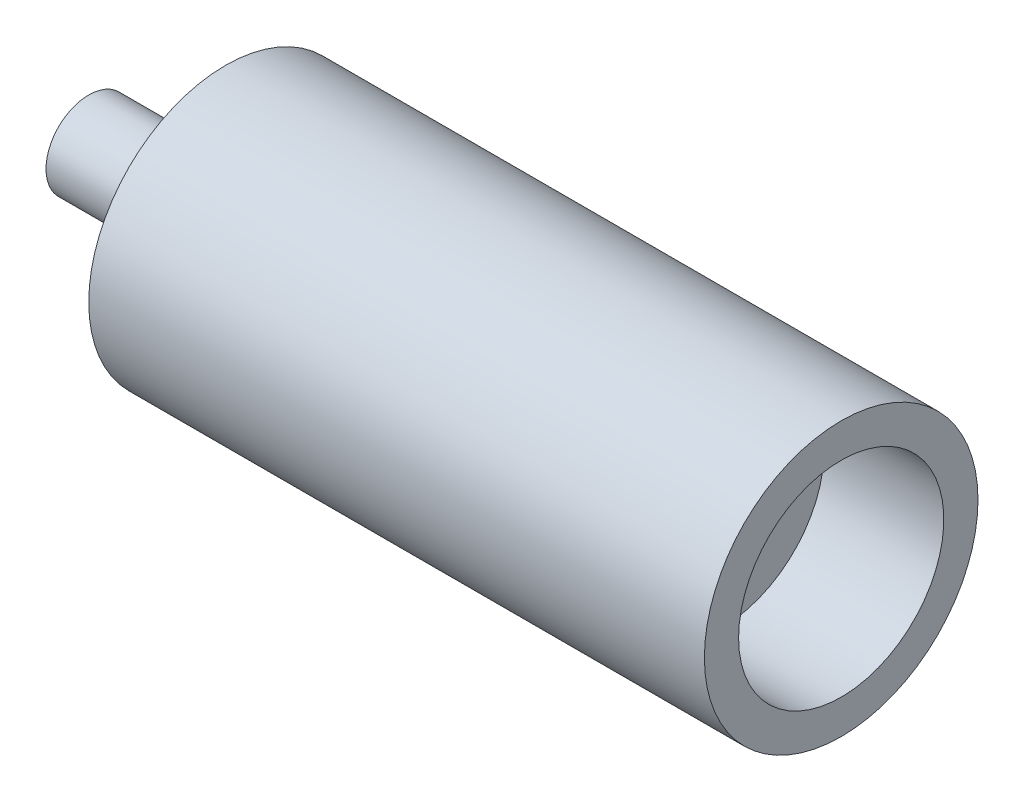
ISO-10303-21;
HEADER;
FILE_DESCRIPTION(('STEP AP214'),'2;1');
FILE_NAME('part.step','',(''),(''),'','','');
FILE_SCHEMA(('AUTOMOTIVE_DESIGN { 1 0 10303 214 1 1 1 1 }'));
ENDSEC;
DATA;
#1=APPLICATION_CONTEXT('core data for automotive mechanical design processes');
#2=APPLICATION_PROTOCOL_DEFINITION('international standard','automotive_design',2000,#1);
#3=PRODUCT_CONTEXT('',#1,'mechanical');
#4=PRODUCT('Part','Part','',(#3));
#5=PRODUCT_RELATED_PRODUCT_CATEGORY('part','',(#4));
#6=PRODUCT_DEFINITION_FORMATION('','',#4);
#7=PRODUCT_DEFINITION_CONTEXT('part definition',#1,'design');
#8=PRODUCT_DEFINITION('design','',#6,#7);
#9=PRODUCT_DEFINITION_SHAPE('','',#8);
#10=(LENGTH_UNIT() NAMED_UNIT(*) SI_UNIT(.MILLI.,.METRE.));
#11=(NAMED_UNIT(*) PLANE_ANGLE_UNIT() SI_UNIT($,.RADIAN.));
#12=(NAMED_UNIT(*) SI_UNIT($,.STERADIAN.) SOLID_ANGLE_UNIT());
#13=UNCERTAINTY_MEASURE_WITH_UNIT(LENGTH_MEASURE(1.E-05),#10,'distance_accuracy_value','');
#14=(GEOMETRIC_REPRESENTATION_CONTEXT(3) GLOBAL_UNCERTAINTY_ASSIGNED_CONTEXT((#13)) GLOBAL_UNIT_ASSIGNED_CONTEXT((#10,
#11,#12)) REPRESENTATION_CONTEXT('',''));
#15=CARTESIAN_POINT('',(0.,0.,0.));
#16=DIRECTION('',(0.,0.,1.));
#17=DIRECTION('',(1.,0.,0.));
#18=AXIS2_PLACEMENT_3D('',#15,#16,#17);
#19=CARTESIAN_POINT('',(1.4249709278377,0.,0.));
#20=DIRECTION('',(-1.,0.,0.));
#21=DIRECTION('',(0.,0.,1.));
#22=AXIS2_PLACEMENT_3D('',#19,#20,#21);
#23=CYLINDRICAL_SURFACE('',#22,12.5);
#24=CARTESIAN_POINT('',(0.,0.,0.));
#25=DIRECTION('',(-1.,0.,0.));
#26=DIRECTION('',(0.,0.,1.));
#27=AXIS2_PLACEMENT_3D('',#24,#25,#26);
#28=CIRCLE('',#27,12.5);
#29=CARTESIAN_POINT('',(0.,0.,12.5));
#30=VERTEX_POINT('',#29);
#31=EDGE_CURVE('E10',#30,#30,#28,.T.);
#32=ORIENTED_EDGE('',*,*,#31,.F.);
#33=EDGE_LOOP('',(#32));
#34=FACE_BOUND('',#33,.T.);
#35=CARTESIAN_POINT('',(30.,0.,0.));
#36=DIRECTION('',(-1.,0.,0.));
#37=DIRECTION('',(0.,0.,1.));
#38=AXIS2_PLACEMENT_3D('',#35,#36,#37);
#39=CIRCLE('',#38,12.5);
#40=CARTESIAN_POINT('',(30.,0.,12.5));
#41=VERTEX_POINT('',#40);
#42=EDGE_CURVE('E105',#41,#41,#39,.T.);
#43=ORIENTED_EDGE('',*,*,#42,.T.);
#44=EDGE_LOOP('',(#43));
#45=FACE_BOUND('',#44,.T.);
#46=ADVANCED_FACE('F42',(#34,#45),#23,.T.);
#47=CARTESIAN_POINT('',(0.,6.35,0.));
#48=DIRECTION('',(1.,0.,0.));
#49=DIRECTION('',(0.,0.,-1.));
#50=AXIS2_PLACEMENT_3D('',#47,#48,#49);
#51=PLANE('',#50);
#52=CARTESIAN_POINT('',(0.,0.,0.));
#53=DIRECTION('',(-1.,0.,0.));
#54=DIRECTION('',(0.,0.,1.));
#55=AXIS2_PLACEMENT_3D('',#52,#53,#54);
#56=CIRCLE('',#55,6.35);
#57=CARTESIAN_POINT('',(0.,0.,6.35));
#58=VERTEX_POINT('',#57);
#59=EDGE_CURVE('E49',#58,#58,#56,.T.);
#60=ORIENTED_EDGE('',*,*,#59,.F.);
#61=EDGE_LOOP('',(#60));
#62=FACE_BOUND('',#61,.T.);
#63=ORIENTED_EDGE('',*,*,#31,.T.);
#64=EDGE_LOOP('',(#63));
#65=FACE_BOUND('',#64,.T.);
#66=ADVANCED_FACE('F185',(#62,#65),#51,.F.);
#67=CARTESIAN_POINT('',(1.4249709278377,0.,0.));
#68=DIRECTION('',(-1.,0.,0.));
#69=DIRECTION('',(0.,0.,1.));
#70=AXIS2_PLACEMENT_3D('',#67,#68,#69);
#71=CYLINDRICAL_SURFACE('',#70,6.35);
#72=CARTESIAN_POINT('',(50.,0.,0.));
#73=DIRECTION('',(-1.,0.,0.));
#74=DIRECTION('',(0.,0.,1.));
#75=AXIS2_PLACEMENT_3D('',#72,#73,#74);
#76=CIRCLE('',#75,6.35);
#77=CARTESIAN_POINT('',(50.,0.,6.35));
#78=VERTEX_POINT('',#77);
#79=EDGE_CURVE('E54',#78,#78,#76,.T.);
#80=ORIENTED_EDGE('',*,*,#79,.F.);
#81=EDGE_LOOP('',(#80));
#82=FACE_BOUND('',#81,.T.);
#83=ORIENTED_EDGE('',*,*,#59,.T.);
#84=EDGE_LOOP('',(#83));
#85=FACE_BOUND('',#84,.T.);
#86=ADVANCED_FACE('F180',(#82,#85),#71,.F.);
#87=CARTESIAN_POINT('',(50.,6.35,0.));
#88=DIRECTION('',(1.,0.,0.));
#89=DIRECTION('',(0.,0.,-1.));
#90=AXIS2_PLACEMENT_3D('',#87,#88,#89);
#91=PLANE('',#90);
#92=CARTESIAN_POINT('',(50.,0.,0.));
#93=DIRECTION('',(-1.,0.,0.));
#94=DIRECTION('',(0.,0.,1.));
#95=AXIS2_PLACEMENT_3D('',#92,#93,#94);
#96=CIRCLE('',#95,5.);
#97=CARTESIAN_POINT('',(50.,0.,5.));
#98=VERTEX_POINT('',#97);
#99=EDGE_CURVE('E59',#98,#98,#96,.T.);
#100=ORIENTED_EDGE('',*,*,#99,.F.);
#101=EDGE_LOOP('',(#100));
#102=FACE_BOUND('',#101,.T.);
#103=ORIENTED_EDGE('',*,*,#79,.T.);
#104=EDGE_LOOP('',(#103));
#105=FACE_BOUND('',#104,.T.);
#106=ADVANCED_FACE('F174',(#102,#105),#91,.F.);
#107=CARTESIAN_POINT('',(1.4249709278377,0.,0.));
#108=DIRECTION('',(-1.,0.,0.));
#109=DIRECTION('',(0.,0.,1.));
#110=AXIS2_PLACEMENT_3D('',#107,#108,#109);
#111=CYLINDRICAL_SURFACE('',#110,5.);
#112=CARTESIAN_POINT('',(185.,0.,0.));
#113=DIRECTION('',(-1.,0.,0.));
#114=DIRECTION('',(0.,0.,1.));
#115=AXIS2_PLACEMENT_3D('',#112,#113,#114);
#116=CIRCLE('',#115,5.);
#117=CARTESIAN_POINT('',(185.,0.,5.));
#118=VERTEX_POINT('',#117);
#119=EDGE_CURVE('E65',#118,#118,#116,.T.);
#120=ORIENTED_EDGE('',*,*,#119,.F.);
#121=EDGE_LOOP('',(#120));
#122=FACE_BOUND('',#121,.T.);
#123=ORIENTED_EDGE('',*,*,#99,.T.);
#124=EDGE_LOOP('',(#123));
#125=FACE_BOUND('',#124,.T.);
#126=ADVANCED_FACE('F168',(#122,#125),#111,.F.);
#127=CARTESIAN_POINT('',(185.,30.,0.));
#128=DIRECTION('',(-1.,0.,0.));
#129=DIRECTION('',(0.,0.,1.));
#130=AXIS2_PLACEMENT_3D('',#127,#128,#129);
#131=PLANE('',#130);
#132=CARTESIAN_POINT('',(185.,0.,0.));
#133=DIRECTION('',(-1.,0.,0.));
#134=DIRECTION('',(0.,0.,1.));
#135=AXIS2_PLACEMENT_3D('',#132,#133,#134);
#136=CIRCLE('',#135,30.);
#137=CARTESIAN_POINT('',(185.,0.,30.));
#138=VERTEX_POINT('',#137);
#139=EDGE_CURVE('E69',#138,#138,#136,.T.);
#140=ORIENTED_EDGE('',*,*,#139,.F.);
#141=EDGE_LOOP('',(#140));
#142=FACE_BOUND('',#141,.T.);
#143=ORIENTED_EDGE('',*,*,#119,.T.);
#144=EDGE_LOOP('',(#143));
#145=FACE_BOUND('',#144,.T.);
#146=ADVANCED_FACE('F162',(#142,#145),#131,.F.);
#147=CARTESIAN_POINT('',(1.4249709278377,0.,0.));
#148=DIRECTION('',(-1.,0.,0.));
#149=DIRECTION('',(0.,0.,1.));
#150=AXIS2_PLACEMENT_3D('',#147,#148,#149);
#151=CYLINDRICAL_SURFACE('',#150,30.);
#152=CARTESIAN_POINT('',(220.,0.,0.));
#153=DIRECTION('',(-1.,0.,0.));
#154=DIRECTION('',(0.,0.,1.));
#155=AXIS2_PLACEMENT_3D('',#152,#153,#154);
#156=CIRCLE('',#155,30.);
#157=CARTESIAN_POINT('',(220.,0.,30.));
#158=VERTEX_POINT('',#157);
#159=EDGE_CURVE('E73',#158,#158,#156,.T.);
#160=ORIENTED_EDGE('',*,*,#159,.F.);
#161=EDGE_LOOP('',(#160));
#162=FACE_BOUND('',#161,.T.);
#163=ORIENTED_EDGE('',*,*,#139,.T.);
#164=EDGE_LOOP('',(#163));
#165=FACE_BOUND('',#164,.T.);
#166=ADVANCED_FACE('F156',(#162,#165),#151,.F.);
#167=CARTESIAN_POINT('',(220.,40.,0.));
#168=DIRECTION('',(-1.,0.,0.));
#169=DIRECTION('',(0.,0.,1.));
#170=AXIS2_PLACEMENT_3D('',#167,#168,#169);
#171=PLANE('',#170);
#172=CARTESIAN_POINT('',(220.,0.,0.));
#173=DIRECTION('',(-1.,0.,0.));
#174=DIRECTION('',(0.,0.,1.));
#175=AXIS2_PLACEMENT_3D('',#172,#173,#174);
#176=CIRCLE('',#175,40.);
#177=CARTESIAN_POINT('',(220.,0.,40.));
#178=VERTEX_POINT('',#177);
#179=EDGE_CURVE('E77',#178,#178,#176,.T.);
#180=ORIENTED_EDGE('',*,*,#179,.F.);
#181=EDGE_LOOP('',(#180));
#182=FACE_BOUND('',#181,.T.);
#183=ORIENTED_EDGE('',*,*,#159,.T.);
#184=EDGE_LOOP('',(#183));
#185=FACE_BOUND('',#184,.T.);
#186=ADVANCED_FACE('F150',(#182,#185),#171,.F.);
#187=CARTESIAN_POINT('',(1.4249709278377,0.,0.));
#188=DIRECTION('',(-1.,0.,0.));
#189=DIRECTION('',(0.,0.,1.));
#190=AXIS2_PLACEMENT_3D('',#187,#188,#189);
#191=CYLINDRICAL_SURFACE('',#190,40.);
#192=CARTESIAN_POINT('',(40.,0.,0.));
#193=DIRECTION('',(-1.,0.,0.));
#194=DIRECTION('',(0.,0.,1.));
#195=AXIS2_PLACEMENT_3D('',#192,#193,#194);
#196=CIRCLE('',#195,40.);
#197=CARTESIAN_POINT('',(40.,0.,40.));
#198=VERTEX_POINT('',#197);
#199=EDGE_CURVE('E81',#198,#198,#196,.T.);
#200=ORIENTED_EDGE('',*,*,#199,.F.);
#201=EDGE_LOOP('',(#200));
#202=FACE_BOUND('',#201,.T.);
#203=ORIENTED_EDGE('',*,*,#179,.T.);
#204=EDGE_LOOP('',(#203));
#205=FACE_BOUND('',#204,.T.);
#206=ADVANCED_FACE('F144',(#202,#205),#191,.T.);
#207=CARTESIAN_POINT('',(40.,32.5,0.));
#208=DIRECTION('',(1.,0.,0.));
#209=DIRECTION('',(0.,0.,-1.));
#210=AXIS2_PLACEMENT_3D('',#207,#208,#209);
#211=PLANE('',#210);
#212=CARTESIAN_POINT('',(40.,0.,0.));
#213=DIRECTION('',(-1.,0.,0.));
#214=DIRECTION('',(0.,0.,1.));
#215=AXIS2_PLACEMENT_3D('',#212,#213,#214);
#216=CIRCLE('',#215,32.5);
#217=CARTESIAN_POINT('',(40.,0.,32.5));
#218=VERTEX_POINT('',#217);
#219=EDGE_CURVE('E85',#218,#218,#216,.T.);
#220=ORIENTED_EDGE('',*,*,#219,.F.);
#221=EDGE_LOOP('',(#220));
#222=FACE_BOUND('',#221,.T.);
#223=ORIENTED_EDGE('',*,*,#199,.T.);
#224=EDGE_LOOP('',(#223));
#225=FACE_BOUND('',#224,.T.);
#226=ADVANCED_FACE('F138',(#222,#225),#211,.F.);
#227=CARTESIAN_POINT('',(1.4249709278377,0.,0.));
#228=DIRECTION('',(-1.,0.,0.));
#229=DIRECTION('',(0.,0.,1.));
#230=AXIS2_PLACEMENT_3D('',#227,#228,#229);
#231=CYLINDRICAL_SURFACE('',#230,32.5);
#232=CARTESIAN_POINT('',(35.,0.,0.));
#233=DIRECTION('',(-1.,0.,0.));
#234=DIRECTION('',(0.,0.,1.));
#235=AXIS2_PLACEMENT_3D('',#232,#233,#234);
#236=CIRCLE('',#235,32.5);
#237=CARTESIAN_POINT('',(35.,0.,32.5));
#238=VERTEX_POINT('',#237);
#239=EDGE_CURVE('E89',#238,#238,#236,.T.);
#240=ORIENTED_EDGE('',*,*,#239,.F.);
#241=EDGE_LOOP('',(#240));
#242=FACE_BOUND('',#241,.T.);
#243=ORIENTED_EDGE('',*,*,#219,.T.);
#244=EDGE_LOOP('',(#243));
#245=FACE_BOUND('',#244,.T.);
#246=ADVANCED_FACE('F132',(#242,#245),#231,.T.);
#247=CARTESIAN_POINT('',(35.,25.,0.));
#248=DIRECTION('',(1.,0.,0.));
#249=DIRECTION('',(0.,0.,-1.));
#250=AXIS2_PLACEMENT_3D('',#247,#248,#249);
#251=PLANE('',#250);
#252=CARTESIAN_POINT('',(35.,0.,0.));
#253=DIRECTION('',(-1.,0.,0.));
#254=DIRECTION('',(0.,0.,1.));
#255=AXIS2_PLACEMENT_3D('',#252,#253,#254);
#256=CIRCLE('',#255,25.);
#257=CARTESIAN_POINT('',(35.,0.,25.));
#258=VERTEX_POINT('',#257);
#259=EDGE_CURVE('E93',#258,#258,#256,.T.);
#260=ORIENTED_EDGE('',*,*,#259,.F.);
#261=EDGE_LOOP('',(#260));
#262=FACE_BOUND('',#261,.T.);
#263=ORIENTED_EDGE('',*,*,#239,.T.);
#264=EDGE_LOOP('',(#263));
#265=FACE_BOUND('',#264,.T.);
#266=ADVANCED_FACE('F126',(#262,#265),#251,.F.);
#267=CARTESIAN_POINT('',(1.4249709278377,0.,0.));
#268=DIRECTION('',(-1.,0.,0.));
#269=DIRECTION('',(0.,0.,1.));
#270=AXIS2_PLACEMENT_3D('',#267,#268,#269);
#271=CYLINDRICAL_SURFACE('',#270,25.);
#272=CARTESIAN_POINT('',(33.,0.,0.));
#273=DIRECTION('',(-1.,0.,0.));
#274=DIRECTION('',(0.,0.,1.));
#275=AXIS2_PLACEMENT_3D('',#272,#273,#274);
#276=CIRCLE('',#275,25.);
#277=CARTESIAN_POINT('',(33.,0.,25.));
#278=VERTEX_POINT('',#277);
#279=EDGE_CURVE('E97',#278,#278,#276,.T.);
#280=ORIENTED_EDGE('',*,*,#279,.F.);
#281=EDGE_LOOP('',(#280));
#282=FACE_BOUND('',#281,.T.);
#283=ORIENTED_EDGE('',*,*,#259,.T.);
#284=EDGE_LOOP('',(#283));
#285=FACE_BOUND('',#284,.T.);
#286=ADVANCED_FACE('F120',(#282,#285),#271,.T.);
#287=CARTESIAN_POINT('',(33.,0.,0.));
#288=DIRECTION('',(1.,0.,0.));
#289=DIRECTION('',(0.,0.,-1.));
#290=AXIS2_PLACEMENT_3D('',#287,#288,#289);
#291=CONICAL_SURFACE('',#290,25.,1.03037682652431);
#292=CARTESIAN_POINT('',(30.,0.,0.));
#293=DIRECTION('',(-1.,0.,0.));
#294=DIRECTION('',(0.,0.,1.));
#295=AXIS2_PLACEMENT_3D('',#292,#293,#294);
#296=CIRCLE('',#295,20.);
#297=CARTESIAN_POINT('',(30.,0.,20.));
#298=VERTEX_POINT('',#297);
#299=EDGE_CURVE('E101',#298,#298,#296,.T.);
#300=ORIENTED_EDGE('',*,*,#299,.F.);
#301=EDGE_LOOP('',(#300));
#302=FACE_BOUND('',#301,.T.);
#303=ORIENTED_EDGE('',*,*,#279,.T.);
#304=EDGE_LOOP('',(#303));
#305=FACE_BOUND('',#304,.T.);
#306=ADVANCED_FACE('F114',(#302,#305),#291,.T.);
#307=CARTESIAN_POINT('',(30.,12.5,0.));
#308=DIRECTION('',(1.,0.,0.));
#309=DIRECTION('',(0.,0.,-1.));
#310=AXIS2_PLACEMENT_3D('',#307,#308,#309);
#311=PLANE('',#310);
#312=ORIENTED_EDGE('',*,*,#42,.F.);
#313=EDGE_LOOP('',(#312));
#314=FACE_BOUND('',#313,.T.);
#315=ORIENTED_EDGE('',*,*,#299,.T.);
#316=EDGE_LOOP('',(#315));
#317=FACE_BOUND('',#316,.T.);
#318=ADVANCED_FACE('F111',(#314,#317),#311,.F.);
#319=CLOSED_SHELL('',(#46,#66,#86,#106,#126,#146,#166,#186,#206,#226,#246,#266,#286,#306,#318));
#320=MANIFOLD_SOLID_BREP('B2',#319);
#321=ADVANCED_BREP_SHAPE_REPRESENTATION('',(#18,#320),#14);
#322=SHAPE_DEFINITION_REPRESENTATION(#9,#321);
ENDSEC;
END-ISO-10303-21;
